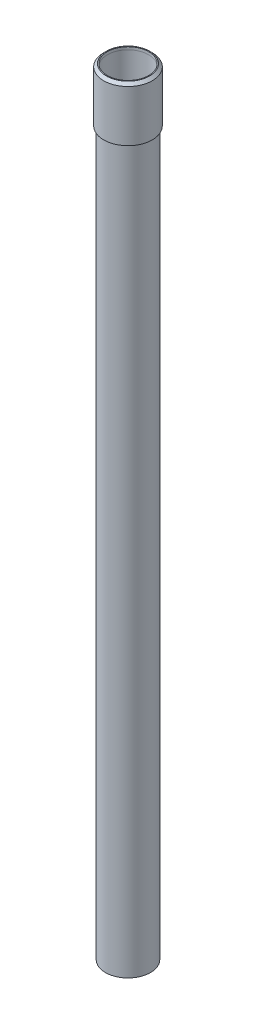
ISO-10303-21;
HEADER;
FILE_DESCRIPTION(('STEP AP214'),'2;1');
FILE_NAME('part.step','',(''),(''),'','','');
FILE_SCHEMA(('AUTOMOTIVE_DESIGN { 1 0 10303 214 1 1 1 1 }'));
ENDSEC;
DATA;
#1=APPLICATION_CONTEXT('core data for automotive mechanical design processes');
#2=APPLICATION_PROTOCOL_DEFINITION('international standard','automotive_design',2000,#1);
#3=PRODUCT_CONTEXT('',#1,'mechanical');
#4=PRODUCT('Part','Part','',(#3));
#5=PRODUCT_RELATED_PRODUCT_CATEGORY('part','',(#4));
#6=PRODUCT_DEFINITION_FORMATION('','',#4);
#7=PRODUCT_DEFINITION_CONTEXT('part definition',#1,'design');
#8=PRODUCT_DEFINITION('design','',#6,#7);
#9=PRODUCT_DEFINITION_SHAPE('','',#8);
#10=(LENGTH_UNIT() NAMED_UNIT(*) SI_UNIT(.MILLI.,.METRE.));
#11=(NAMED_UNIT(*) PLANE_ANGLE_UNIT() SI_UNIT($,.RADIAN.));
#12=(NAMED_UNIT(*) SI_UNIT($,.STERADIAN.) SOLID_ANGLE_UNIT());
#13=UNCERTAINTY_MEASURE_WITH_UNIT(LENGTH_MEASURE(1.E-05),#10,'distance_accuracy_value','');
#14=(GEOMETRIC_REPRESENTATION_CONTEXT(3) GLOBAL_UNCERTAINTY_ASSIGNED_CONTEXT((#13)) GLOBAL_UNIT_ASSIGNED_CONTEXT((#10,
#11,#12)) REPRESENTATION_CONTEXT('',''));
#15=CARTESIAN_POINT('',(0.,0.,0.));
#16=DIRECTION('',(0.,0.,1.));
#17=DIRECTION('',(1.,0.,0.));
#18=AXIS2_PLACEMENT_3D('',#15,#16,#17);
#19=CARTESIAN_POINT('',(0.,224.324804611186,0.));
#20=DIRECTION('',(0.,1.,0.));
#21=DIRECTION('',(0.,0.,1.));
#22=AXIS2_PLACEMENT_3D('',#19,#20,#21);
#23=CYLINDRICAL_SURFACE('',#22,12.5);
#24=CARTESIAN_POINT('',(0.,186.5,0.));
#25=DIRECTION('',(0.,1.,0.));
#26=DIRECTION('',(0.,0.,1.));
#27=AXIS2_PLACEMENT_3D('',#24,#25,#26);
#28=CIRCLE('',#27,12.5);
#29=CARTESIAN_POINT('',(0.,186.5,12.5));
#30=VERTEX_POINT('',#29);
#31=EDGE_CURVE('E53',#30,#30,#28,.T.);
#32=ORIENTED_EDGE('',*,*,#31,.F.);
#33=EDGE_LOOP('',(#32));
#34=FACE_BOUND('',#33,.T.);
#35=CARTESIAN_POINT('',(0.,215.,0.));
#36=DIRECTION('',(0.,1.,0.));
#37=DIRECTION('',(0.,0.,1.));
#38=AXIS2_PLACEMENT_3D('',#35,#36,#37);
#39=CIRCLE('',#38,12.5);
#40=CARTESIAN_POINT('',(0.,215.,12.5));
#41=VERTEX_POINT('',#40);
#42=EDGE_CURVE('E68',#41,#41,#39,.T.);
#43=ORIENTED_EDGE('',*,*,#42,.T.);
#44=EDGE_LOOP('',(#43));
#45=FACE_BOUND('',#44,.T.);
#46=ADVANCED_FACE('F42',(#34,#45),#23,.F.);
#47=CARTESIAN_POINT('',(13.5,186.5,0.));
#48=DIRECTION('',(0.,1.,0.));
#49=DIRECTION('',(0.,0.,1.));
#50=AXIS2_PLACEMENT_3D('',#47,#48,#49);
#51=PLANE('',#50);
#52=CARTESIAN_POINT('',(0.,186.5,0.));
#53=DIRECTION('',(0.,1.,0.));
#54=DIRECTION('',(0.,0.,1.));
#55=AXIS2_PLACEMENT_3D('',#52,#53,#54);
#56=CIRCLE('',#55,13.5);
#57=CARTESIAN_POINT('',(0.,186.5,13.5));
#58=VERTEX_POINT('',#57);
#59=EDGE_CURVE('E57',#58,#58,#56,.T.);
#60=ORIENTED_EDGE('',*,*,#59,.F.);
#61=EDGE_LOOP('',(#60));
#62=FACE_BOUND('',#61,.T.);
#63=ORIENTED_EDGE('',*,*,#31,.T.);
#64=EDGE_LOOP('',(#63));
#65=FACE_BOUND('',#64,.T.);
#66=ADVANCED_FACE('F92',(#62,#65),#51,.F.);
#67=CARTESIAN_POINT('',(0.,224.324804611186,0.));
#68=DIRECTION('',(0.,1.,0.));
#69=DIRECTION('',(0.,0.,1.));
#70=AXIS2_PLACEMENT_3D('',#67,#68,#69);
#71=CYLINDRICAL_SURFACE('',#70,13.5);
#72=CARTESIAN_POINT('',(0.,215.,0.));
#73=DIRECTION('',(0.,-1.,0.));
#74=DIRECTION('',(0.,0.,-1.));
#75=AXIS2_PLACEMENT_3D('',#72,#73,#74);
#76=CIRCLE('',#75,13.5);
#77=CARTESIAN_POINT('',(0.,215.,-13.5));
#78=VERTEX_POINT('',#77);
#79=EDGE_CURVE('E11',#78,#78,#76,.T.);
#80=ORIENTED_EDGE('',*,*,#79,.T.);
#81=EDGE_LOOP('',(#80));
#82=FACE_BOUND('',#81,.T.);
#83=ORIENTED_EDGE('',*,*,#59,.T.);
#84=EDGE_LOOP('',(#83));
#85=FACE_BOUND('',#84,.T.);
#86=ADVANCED_FACE('F87',(#82,#85),#71,.T.);
#87=CARTESIAN_POINT('',(13.5,216.5,0.));
#88=DIRECTION('',(0.,-1.,0.));
#89=DIRECTION('',(0.,0.,-1.));
#90=AXIS2_PLACEMENT_3D('',#87,#88,#89);
#91=PLANE('',#90);
#92=CARTESIAN_POINT('',(0.,216.5,0.));
#93=DIRECTION('',(0.,-1.,0.));
#94=DIRECTION('',(0.,0.,-1.));
#95=AXIS2_PLACEMENT_3D('',#92,#93,#94);
#96=CIRCLE('',#95,12.);
#97=CARTESIAN_POINT('',(0.,216.5,-12.));
#98=VERTEX_POINT('',#97);
#99=EDGE_CURVE('E49',#98,#98,#96,.F.);
#100=ORIENTED_EDGE('',*,*,#99,.T.);
#101=EDGE_LOOP('',(#100));
#102=FACE_BOUND('',#101,.T.);
#103=CARTESIAN_POINT('',(0.,216.5,0.));
#104=DIRECTION('',(0.,1.,0.));
#105=DIRECTION('',(0.,0.,1.));
#106=AXIS2_PLACEMENT_3D('',#103,#104,#105);
#107=CIRCLE('',#106,11.5);
#108=CARTESIAN_POINT('',(0.,216.5,11.5));
#109=VERTEX_POINT('',#108);
#110=EDGE_CURVE('E62',#109,#109,#107,.T.);
#111=ORIENTED_EDGE('',*,*,#110,.F.);
#112=EDGE_LOOP('',(#111));
#113=FACE_BOUND('',#112,.T.);
#114=ADVANCED_FACE('F82',(#102,#113),#91,.F.);
#115=CARTESIAN_POINT('',(0.,224.324804611186,0.));
#116=DIRECTION('',(0.,1.,0.));
#117=DIRECTION('',(0.,0.,1.));
#118=AXIS2_PLACEMENT_3D('',#115,#116,#117);
#119=CYLINDRICAL_SURFACE('',#118,11.5);
#120=CARTESIAN_POINT('',(0.,215.,0.));
#121=DIRECTION('',(0.,1.,0.));
#122=DIRECTION('',(0.,0.,1.));
#123=AXIS2_PLACEMENT_3D('',#120,#121,#122);
#124=CIRCLE('',#123,11.5);
#125=CARTESIAN_POINT('',(0.,215.,11.5));
#126=VERTEX_POINT('',#125);
#127=EDGE_CURVE('E65',#126,#126,#124,.T.);
#128=ORIENTED_EDGE('',*,*,#127,.F.);
#129=EDGE_LOOP('',(#128));
#130=FACE_BOUND('',#129,.T.);
#131=ORIENTED_EDGE('',*,*,#110,.T.);
#132=EDGE_LOOP('',(#131));
#133=FACE_BOUND('',#132,.T.);
#134=ADVANCED_FACE('F76',(#130,#133),#119,.F.);
#135=CARTESIAN_POINT('',(12.5,215.,0.));
#136=DIRECTION('',(0.,1.,0.));
#137=DIRECTION('',(0.,0.,1.));
#138=AXIS2_PLACEMENT_3D('',#135,#136,#137);
#139=PLANE('',#138);
#140=ORIENTED_EDGE('',*,*,#42,.F.);
#141=EDGE_LOOP('',(#140));
#142=FACE_BOUND('',#141,.T.);
#143=ORIENTED_EDGE('',*,*,#127,.T.);
#144=EDGE_LOOP('',(#143));
#145=FACE_BOUND('',#144,.T.);
#146=ADVANCED_FACE('F73',(#142,#145),#139,.F.);
#147=CARTESIAN_POINT('',(0.,216.5,0.));
#148=DIRECTION('',(0.,-1.,0.));
#149=DIRECTION('',(0.,0.,-1.));
#150=AXIS2_PLACEMENT_3D('',#147,#148,#149);
#151=CONICAL_SURFACE('',#150,12.,0.785398163397452);
#152=ORIENTED_EDGE('',*,*,#79,.F.);
#153=EDGE_LOOP('',(#152));
#154=FACE_BOUND('',#153,.T.);
#155=ORIENTED_EDGE('',*,*,#99,.F.);
#156=EDGE_LOOP('',(#155));
#157=FACE_BOUND('',#156,.T.);
#158=ADVANCED_FACE('F44',(#154,#157),#151,.T.);
#159=CLOSED_SHELL('',(#46,#66,#86,#114,#134,#146,#158));
#160=MANIFOLD_SOLID_BREP('B2',#159);
#161=CARTESIAN_POINT('',(0.,215.,0.));
#162=DIRECTION('',(0.,1.,0.));
#163=DIRECTION('',(0.,0.,1.));
#164=AXIS2_PLACEMENT_3D('',#161,#162,#163);
#165=PLANE('',#164);
#166=CARTESIAN_POINT('',(0.,215.,0.));
#167=DIRECTION('',(0.,1.,0.));
#168=DIRECTION('',(0.,0.,1.));
#169=AXIS2_PLACEMENT_3D('',#166,#167,#168);
#170=CIRCLE('',#169,12.5);
#171=CARTESIAN_POINT('',(0.,215.,12.5));
#172=VERTEX_POINT('',#171);
#173=EDGE_CURVE('E41',#172,#172,#170,.T.);
#174=ORIENTED_EDGE('',*,*,#173,.T.);
#175=EDGE_LOOP('',(#174));
#176=FACE_BOUND('',#175,.T.);
#177=CARTESIAN_POINT('',(0.,215.,0.));
#178=DIRECTION('',(0.,1.,0.));
#179=DIRECTION('',(0.,0.,1.));
#180=AXIS2_PLACEMENT_3D('',#177,#178,#179);
#181=CIRCLE('',#180,11.5);
#182=CARTESIAN_POINT('',(0.,215.,11.5));
#183=VERTEX_POINT('',#182);
#184=EDGE_CURVE('E159',#183,#183,#181,.T.);
#185=ORIENTED_EDGE('',*,*,#184,.F.);
#186=EDGE_LOOP('',(#185));
#187=FACE_BOUND('',#186,.T.);
#188=ADVANCED_FACE('F148',(#176,#187),#165,.T.);
#189=CARTESIAN_POINT('',(0.,-215.,0.));
#190=DIRECTION('',(0.,1.,0.));
#191=DIRECTION('',(0.,0.,1.));
#192=AXIS2_PLACEMENT_3D('',#189,#190,#191);
#193=PLANE('',#192);
#194=CARTESIAN_POINT('',(0.,-215.,0.));
#195=DIRECTION('',(0.,1.,0.));
#196=DIRECTION('',(0.,0.,1.));
#197=AXIS2_PLACEMENT_3D('',#194,#195,#196);
#198=CIRCLE('',#197,12.5);
#199=CARTESIAN_POINT('',(0.,-215.,12.5));
#200=VERTEX_POINT('',#199);
#201=EDGE_CURVE('E152',#200,#200,#198,.T.);
#202=ORIENTED_EDGE('',*,*,#201,.F.);
#203=EDGE_LOOP('',(#202));
#204=FACE_BOUND('',#203,.T.);
#205=CARTESIAN_POINT('',(0.,-215.,0.));
#206=DIRECTION('',(0.,1.,0.));
#207=DIRECTION('',(0.,0.,1.));
#208=AXIS2_PLACEMENT_3D('',#205,#206,#207);
#209=CIRCLE('',#208,11.5);
#210=CARTESIAN_POINT('',(0.,-215.,11.5));
#211=VERTEX_POINT('',#210);
#212=EDGE_CURVE('E161',#211,#211,#209,.T.);
#213=ORIENTED_EDGE('',*,*,#212,.T.);
#214=EDGE_LOOP('',(#213));
#215=FACE_BOUND('',#214,.T.);
#216=ADVANCED_FACE('F171',(#204,#215),#193,.F.);
#217=CARTESIAN_POINT('',(0.,215.,0.));
#218=DIRECTION('',(0.,-1.,0.));
#219=DIRECTION('',(0.,0.,-1.));
#220=AXIS2_PLACEMENT_3D('',#217,#218,#219);
#221=CYLINDRICAL_SURFACE('',#220,12.5);
#222=ORIENTED_EDGE('',*,*,#173,.F.);
#223=EDGE_LOOP('',(#222));
#224=FACE_BOUND('',#223,.T.);
#225=ORIENTED_EDGE('',*,*,#201,.T.);
#226=EDGE_LOOP('',(#225));
#227=FACE_BOUND('',#226,.T.);
#228=ADVANCED_FACE('F150',(#224,#227),#221,.T.);
#229=CARTESIAN_POINT('',(0.,215.,0.));
#230=DIRECTION('',(0.,-1.,0.));
#231=DIRECTION('',(0.,0.,-1.));
#232=AXIS2_PLACEMENT_3D('',#229,#230,#231);
#233=CYLINDRICAL_SURFACE('',#232,11.5);
#234=ORIENTED_EDGE('',*,*,#184,.T.);
#235=EDGE_LOOP('',(#234));
#236=FACE_BOUND('',#235,.T.);
#237=ORIENTED_EDGE('',*,*,#212,.F.);
#238=EDGE_LOOP('',(#237));
#239=FACE_BOUND('',#238,.T.);
#240=ADVANCED_FACE('F167',(#236,#239),#233,.F.);
#241=CLOSED_SHELL('',(#188,#216,#228,#240));
#242=MANIFOLD_SOLID_BREP('B6',#241);
#243=ADVANCED_BREP_SHAPE_REPRESENTATION('',(#18,#160,#242),#14);
#244=SHAPE_DEFINITION_REPRESENTATION(#9,#243);
ENDSEC;
END-ISO-10303-21;
